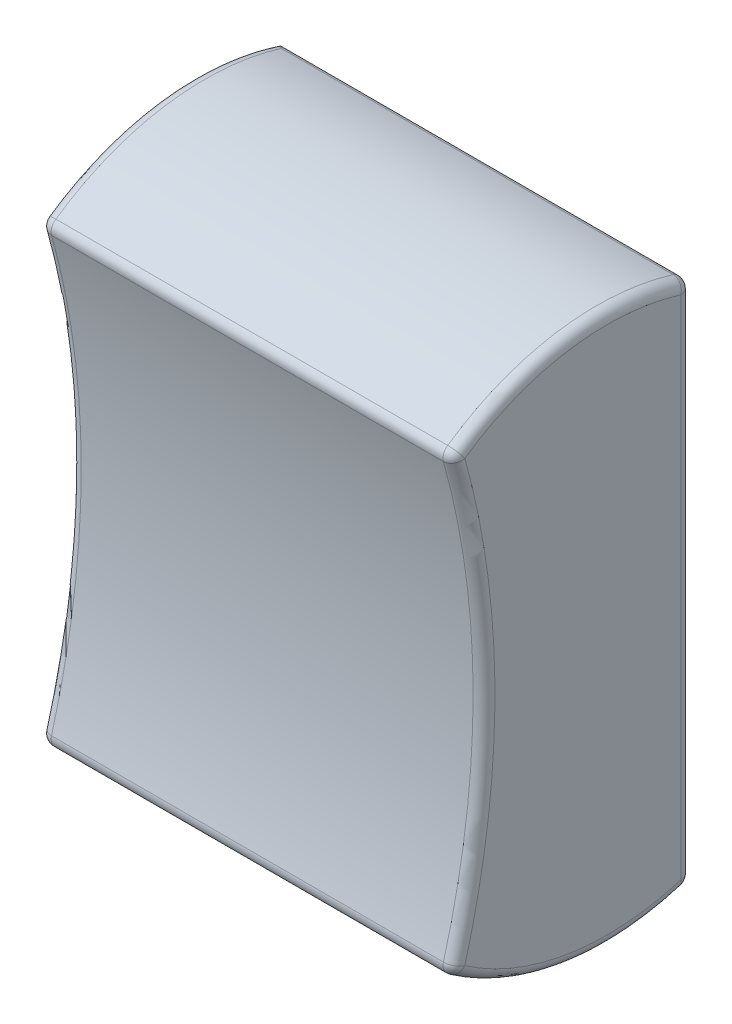
ISO-10303-21;
HEADER;
FILE_DESCRIPTION(('STEP AP214'),'2;1');
FILE_NAME('part.step','',(''),(''),'','','');
FILE_SCHEMA(('AUTOMOTIVE_DESIGN { 1 0 10303 214 1 1 1 1 }'));
ENDSEC;
DATA;
#1=APPLICATION_CONTEXT('core data for automotive mechanical design processes');
#2=APPLICATION_PROTOCOL_DEFINITION('international standard','automotive_design',2000,#1);
#3=PRODUCT_CONTEXT('',#1,'mechanical');
#4=PRODUCT('Part','Part','',(#3));
#5=PRODUCT_RELATED_PRODUCT_CATEGORY('part','',(#4));
#6=PRODUCT_DEFINITION_FORMATION('','',#4);
#7=PRODUCT_DEFINITION_CONTEXT('part definition',#1,'design');
#8=PRODUCT_DEFINITION('design','',#6,#7);
#9=PRODUCT_DEFINITION_SHAPE('','',#8);
#10=(LENGTH_UNIT() NAMED_UNIT(*) SI_UNIT(.MILLI.,.METRE.));
#11=(NAMED_UNIT(*) PLANE_ANGLE_UNIT() SI_UNIT($,.RADIAN.));
#12=(NAMED_UNIT(*) SI_UNIT($,.STERADIAN.) SOLID_ANGLE_UNIT());
#13=UNCERTAINTY_MEASURE_WITH_UNIT(LENGTH_MEASURE(1.E-05),#10,'distance_accuracy_value','');
#14=(GEOMETRIC_REPRESENTATION_CONTEXT(3) GLOBAL_UNCERTAINTY_ASSIGNED_CONTEXT((#13)) GLOBAL_UNIT_ASSIGNED_CONTEXT((#10,
#11,#12)) REPRESENTATION_CONTEXT('',''));
#15=CARTESIAN_POINT('',(0.,0.,0.));
#16=DIRECTION('',(0.,0.,1.));
#17=DIRECTION('',(1.,0.,0.));
#18=AXIS2_PLACEMENT_3D('',#15,#16,#17);
#19=CARTESIAN_POINT('',(9.5,-0.640134880450685,3.86697096777915));
#20=DIRECTION('',(-1.,0.,0.));
#21=DIRECTION('',(0.,0.,1.));
#22=AXIS2_PLACEMENT_3D('',#19,#20,#21);
#23=CYLINDRICAL_SURFACE('',#22,12.);
#24=DIRECTION('',(-1.,0.,0.));
#25=VECTOR('',#24,1.);
#26=CARTESIAN_POINT('',(9.5,-10.4992363122272,10.7078860350742));
#27=LINE('',#26,#25);
#28=CARTESIAN_POINT('',(9.,-10.4992363122272,10.7078860350742));
#29=VERTEX_POINT('',#28);
#30=CARTESIAN_POINT('',(-9.,-10.4992363122272,10.7078860350742));
#31=VERTEX_POINT('',#30);
#32=EDGE_CURVE('E305',#29,#31,#27,.T.);
#33=ORIENTED_EDGE('',*,*,#32,.T.);
#34=CARTESIAN_POINT('',(-9.,-0.640134880450685,3.86697096777915));
#35=DIRECTION('',(1.,0.,0.));
#36=DIRECTION('',(0.,0.,-1.));
#37=AXIS2_PLACEMENT_3D('',#34,#35,#36);
#38=CIRCLE('',#37,12.);
#39=CARTESIAN_POINT('',(-9.,-12.1142925582247,0.353609957922643));
#40=VERTEX_POINT('',#39);
#41=EDGE_CURVE('E300',#31,#40,#38,.T.);
#42=ORIENTED_EDGE('',*,*,#41,.T.);
#43=DIRECTION('',(-1.,0.,0.));
#44=VECTOR('',#43,1.);
#45=CARTESIAN_POINT('',(9.5,-12.1142925582247,0.353609957922643));
#46=LINE('',#45,#44);
#47=CARTESIAN_POINT('',(9.,-12.1142925582247,0.353609957922643));
#48=VERTEX_POINT('',#47);
#49=EDGE_CURVE('E302',#40,#48,#46,.F.);
#50=ORIENTED_EDGE('',*,*,#49,.T.);
#51=CARTESIAN_POINT('',(9.,-0.640134880450685,3.86697096777915));
#52=DIRECTION('',(1.,0.,0.));
#53=DIRECTION('',(0.,0.,-1.));
#54=AXIS2_PLACEMENT_3D('',#51,#52,#53);
#55=CIRCLE('',#54,12.);
#56=EDGE_CURVE('E133',#48,#29,#55,.F.);
#57=ORIENTED_EDGE('',*,*,#56,.T.);
#58=EDGE_LOOP('',(#33,#42,#50,#57));
#59=FACE_BOUND('',#58,.T.);
#60=ADVANCED_FACE('F33',(#59),#23,.T.);
#61=CARTESIAN_POINT('',(9.5,12.,0.));
#62=DIRECTION('',(0.,0.,1.));
#63=DIRECTION('',(0.,-1.,0.));
#64=AXIS2_PLACEMENT_3D('',#61,#62,#63);
#65=PLANE('',#64);
#66=DIRECTION('',(-1.,0.,0.));
#67=VECTOR('',#66,1.);
#68=CARTESIAN_POINT('',(9.5,-11.6362026549841,0.));
#69=LINE('',#68,#67);
#70=CARTESIAN_POINT('',(9.,-11.6362026549841,0.));
#71=VERTEX_POINT('',#70);
#72=CARTESIAN_POINT('',(-9.47497571321353,-11.6362026549841,0.));
#73=VERTEX_POINT('',#72);
#74=EDGE_CURVE('E129',#71,#73,#69,.T.);
#75=ORIENTED_EDGE('',*,*,#74,.T.);
#76=CARTESIAN_POINT('',(-9.47497571321353,-11.6362026549841,0.));
#77=CARTESIAN_POINT('',(-9.4833057981733,-11.6092114088466,0.));
#78=CARTESIAN_POINT('',(-9.48955619791181,-11.5819061148948,0.));
#79=CARTESIAN_POINT('',(-9.49789758816027,-11.5266676882119,0.));
#80=CARTESIAN_POINT('',(-9.49998861735058,-11.4987345613218,0.));
#81=CARTESIAN_POINT('',(-9.5,-11.4704873924585,0.));
#82=B_SPLINE_CURVE_WITH_KNOTS('',3,(#76,#77,#78,#79,#80,#81),.UNSPECIFIED.,.F.,.F.,(4,2,4),(0.,
0.0840346307910023,0.168068480092202),.UNSPECIFIED.);
#83=CARTESIAN_POINT('',(-9.5,-11.4704873924585,0.));
#84=VERTEX_POINT('',#83);
#85=EDGE_CURVE('E123',#73,#84,#82,.T.);
#86=ORIENTED_EDGE('',*,*,#85,.T.);
#87=DIRECTION('',(0.,1.,0.));
#88=VECTOR('',#87,1.);
#89=CARTESIAN_POINT('',(-9.5,12.,0.));
#90=LINE('',#89,#88);
#91=CARTESIAN_POINT('',(-9.5,11.4704873924585,0.));
#92=VERTEX_POINT('',#91);
#93=EDGE_CURVE('E126',#84,#92,#90,.T.);
#94=ORIENTED_EDGE('',*,*,#93,.T.);
#95=CARTESIAN_POINT('',(-9.5,11.4704873924585,0.));
#96=CARTESIAN_POINT('',(-9.49998861735058,11.4987345613218,0.));
#97=CARTESIAN_POINT('',(-9.49789758816027,11.5266676882119,0.));
#98=CARTESIAN_POINT('',(-9.48955619791181,11.5819061148948,0.));
#99=CARTESIAN_POINT('',(-9.4833057981733,11.6092114088466,0.));
#100=CARTESIAN_POINT('',(-9.47497571321353,11.6362026549841,0.));
#101=B_SPLINE_CURVE_WITH_KNOTS('',3,(#95,#96,#97,#98,#99,#100),.UNSPECIFIED.,.F.,.F.,(4,2,4),
(0.,0.084033849301201,0.168068480092204),.UNSPECIFIED.);
#102=CARTESIAN_POINT('',(-9.47497571321353,11.6362026549841,0.));
#103=VERTEX_POINT('',#102);
#104=EDGE_CURVE('E141',#92,#103,#101,.T.);
#105=ORIENTED_EDGE('',*,*,#104,.T.);
#106=DIRECTION('',(-1.,0.,0.));
#107=VECTOR('',#106,1.);
#108=CARTESIAN_POINT('',(9.5,11.6362026549841,0.));
#109=LINE('',#108,#107);
#110=CARTESIAN_POINT('',(9.,11.6362026549841,0.));
#111=VERTEX_POINT('',#110);
#112=EDGE_CURVE('E326',#103,#111,#109,.F.);
#113=ORIENTED_EDGE('',*,*,#112,.T.);
#114=DIRECTION('',(0.,1.,0.));
#115=VECTOR('',#114,1.);
#116=CARTESIAN_POINT('',(9.,-12.,0.));
#117=LINE('',#116,#115);
#118=EDGE_CURVE('E327',#111,#71,#117,.F.);
#119=ORIENTED_EDGE('',*,*,#118,.T.);
#120=EDGE_LOOP('',(#75,#86,#94,#105,#113,#119));
#121=FACE_BOUND('',#120,.T.);
#122=ADVANCED_FACE('F125',(#121),#65,.F.);
#123=CARTESIAN_POINT('',(9.5,0.640134880450685,3.86697096777915));
#124=DIRECTION('',(-1.,0.,0.));
#125=DIRECTION('',(0.,0.,1.));
#126=AXIS2_PLACEMENT_3D('',#123,#124,#125);
#127=CYLINDRICAL_SURFACE('',#126,12.);
#128=DIRECTION('',(-1.,0.,0.));
#129=VECTOR('',#128,1.);
#130=CARTESIAN_POINT('',(9.5,10.4992363122272,10.7078860350742));
#131=LINE('',#130,#129);
#132=CARTESIAN_POINT('',(-9.,10.4992363122272,10.7078860350742));
#133=VERTEX_POINT('',#132);
#134=CARTESIAN_POINT('',(9.,10.4992363122272,10.7078860350742));
#135=VERTEX_POINT('',#134);
#136=EDGE_CURVE('E53',#133,#135,#131,.F.);
#137=ORIENTED_EDGE('',*,*,#136,.T.);
#138=CARTESIAN_POINT('',(9.,0.640134880450685,3.86697096777915));
#139=DIRECTION('',(1.,0.,0.));
#140=DIRECTION('',(0.,0.,-1.));
#141=AXIS2_PLACEMENT_3D('',#138,#139,#140);
#142=CIRCLE('',#141,12.);
#143=CARTESIAN_POINT('',(9.,12.1142925582247,0.353609957922638));
#144=VERTEX_POINT('',#143);
#145=EDGE_CURVE('E11',#135,#144,#142,.F.);
#146=ORIENTED_EDGE('',*,*,#145,.T.);
#147=DIRECTION('',(-1.,0.,0.));
#148=VECTOR('',#147,1.);
#149=CARTESIAN_POINT('',(9.5,12.1142925582247,0.353609957922638));
#150=LINE('',#149,#148);
#151=CARTESIAN_POINT('',(-9.,12.1142925582247,0.353609957922638));
#152=VERTEX_POINT('',#151);
#153=EDGE_CURVE('E42',#144,#152,#150,.T.);
#154=ORIENTED_EDGE('',*,*,#153,.T.);
#155=CARTESIAN_POINT('',(-9.,0.640134880450685,3.86697096777915));
#156=DIRECTION('',(1.,0.,0.));
#157=DIRECTION('',(0.,0.,-1.));
#158=AXIS2_PLACEMENT_3D('',#155,#156,#157);
#159=CIRCLE('',#158,12.);
#160=EDGE_CURVE('E162',#152,#133,#159,.T.);
#161=ORIENTED_EDGE('',*,*,#160,.T.);
#162=EDGE_LOOP('',(#137,#146,#154,#161));
#163=FACE_BOUND('',#162,.T.);
#164=ADVANCED_FACE('F317',(#163),#127,.T.);
#165=CARTESIAN_POINT('',(9.5,0.,46.5403418666731));
#166=DIRECTION('',(-1.,0.,0.));
#167=DIRECTION('',(0.,0.,1.));
#168=AXIS2_PLACEMENT_3D('',#165,#166,#167);
#169=CYLINDRICAL_SURFACE('',#168,36.9999999999999);
#170=DIRECTION('',(-1.,0.,0.));
#171=VECTOR('',#170,1.);
#172=CARTESIAN_POINT('',(9.5,9.95392788031332,10.9044144933956));
#173=LINE('',#172,#171);
#174=CARTESIAN_POINT('',(9.,9.95392788031332,10.9044144933956));
#175=VERTEX_POINT('',#174);
#176=CARTESIAN_POINT('',(-9.,9.95392788031332,10.9044144933956));
#177=VERTEX_POINT('',#176);
#178=EDGE_CURVE('E253',#175,#177,#173,.T.);
#179=ORIENTED_EDGE('',*,*,#178,.T.);
#180=CARTESIAN_POINT('',(-9.,0.,46.5403418666731));
#181=DIRECTION('',(1.,0.,0.));
#182=DIRECTION('',(0.,0.,-1.));
#183=AXIS2_PLACEMENT_3D('',#180,#181,#182);
#184=CIRCLE('',#183,36.9999999999999);
#185=CARTESIAN_POINT('',(-9.,-9.95392788031332,10.9044144933956));
#186=VERTEX_POINT('',#185);
#187=EDGE_CURVE('E287',#177,#186,#184,.F.);
#188=ORIENTED_EDGE('',*,*,#187,.T.);
#189=DIRECTION('',(-1.,0.,0.));
#190=VECTOR('',#189,1.);
#191=CARTESIAN_POINT('',(9.5,-9.95392788031332,10.9044144933956));
#192=LINE('',#191,#190);
#193=CARTESIAN_POINT('',(9.,-9.95392788031332,10.9044144933956));
#194=VERTEX_POINT('',#193);
#195=EDGE_CURVE('E293',#186,#194,#192,.F.);
#196=ORIENTED_EDGE('',*,*,#195,.T.);
#197=CARTESIAN_POINT('',(9.,0.,46.5403418666731));
#198=DIRECTION('',(1.,0.,0.));
#199=DIRECTION('',(0.,0.,-1.));
#200=AXIS2_PLACEMENT_3D('',#197,#198,#199);
#201=CIRCLE('',#200,36.9999999999999);
#202=EDGE_CURVE('E298',#194,#175,#201,.T.);
#203=ORIENTED_EDGE('',*,*,#202,.T.);
#204=EDGE_LOOP('',(#179,#188,#196,#203));
#205=FACE_BOUND('',#204,.T.);
#206=ADVANCED_FACE('F354',(#205),#169,.F.);
#207=CARTESIAN_POINT('',(9.5,-0.640134880450685,3.86697096777915));
#208=DIRECTION('',(1.,0.,0.));
#209=DIRECTION('',(0.,0.,-1.));
#210=AXIS2_PLACEMENT_3D('',#207,#208,#209);
#211=PLANE('',#210);
#212=CARTESIAN_POINT('',(9.5,0.,46.5403418666731));
#213=DIRECTION('',(1.,0.,0.));
#214=DIRECTION('',(0.,0.,-1.));
#215=AXIS2_PLACEMENT_3D('',#212,#213,#214);
#216=CIRCLE('',#215,37.4999999999999);
#217=CARTESIAN_POINT('',(9.5,10.0884404192365,10.4228479072702));
#218=VERTEX_POINT('',#217);
#219=CARTESIAN_POINT('',(9.5,-10.0884404192365,10.4228479072702));
#220=VERTEX_POINT('',#219);
#221=EDGE_CURVE('E148',#218,#220,#216,.F.);
#222=ORIENTED_EDGE('',*,*,#221,.T.);
#223=CARTESIAN_POINT('',(9.5,-0.640134880450685,3.86697096777915));
#224=DIRECTION('',(1.,0.,0.));
#225=DIRECTION('',(0.,0.,-1.));
#226=AXIS2_PLACEMENT_3D('',#223,#224,#225);
#227=CIRCLE('',#226,11.5);
#228=CARTESIAN_POINT('',(9.5,-11.6362026549841,0.499999999999997));
#229=VERTEX_POINT('',#228);
#230=EDGE_CURVE('E159',#220,#229,#227,.T.);
#231=ORIENTED_EDGE('',*,*,#230,.T.);
#232=DIRECTION('',(0.,1.,0.));
#233=VECTOR('',#232,1.);
#234=CARTESIAN_POINT('',(9.5,12.,0.499999999999992));
#235=LINE('',#234,#233);
#236=CARTESIAN_POINT('',(9.5,11.6362026549841,0.499999999999993));
#237=VERTEX_POINT('',#236);
#238=EDGE_CURVE('E157',#229,#237,#235,.T.);
#239=ORIENTED_EDGE('',*,*,#238,.T.);
#240=CARTESIAN_POINT('',(9.5,0.640134880450685,3.86697096777915));
#241=DIRECTION('',(1.,0.,0.));
#242=DIRECTION('',(0.,0.,-1.));
#243=AXIS2_PLACEMENT_3D('',#240,#241,#242);
#244=CIRCLE('',#243,11.5);
#245=EDGE_CURVE('E150',#237,#218,#244,.T.);
#246=ORIENTED_EDGE('',*,*,#245,.T.);
#247=EDGE_LOOP('',(#222,#231,#239,#246));
#248=FACE_BOUND('',#247,.T.);
#249=ADVANCED_FACE('F356',(#248),#211,.T.);
#250=CARTESIAN_POINT('',(-9.5,-0.640134880450685,3.86697096777915));
#251=DIRECTION('',(1.,0.,0.));
#252=DIRECTION('',(0.,0.,-1.));
#253=AXIS2_PLACEMENT_3D('',#250,#251,#252);
#254=PLANE('',#253);
#255=ORIENTED_EDGE('',*,*,#93,.F.);
#256=CARTESIAN_POINT('',(-9.5,-0.640134880450685,3.86697096777915));
#257=DIRECTION('',(1.,0.,0.));
#258=DIRECTION('',(0.,0.,-1.));
#259=AXIS2_PLACEMENT_3D('',#256,#257,#258);
#260=CIRCLE('',#259,11.5);
#261=CARTESIAN_POINT('',(-9.5,-10.0884404192365,10.4228479072702));
#262=VERTEX_POINT('',#261);
#263=EDGE_CURVE('E137',#84,#262,#260,.F.);
#264=ORIENTED_EDGE('',*,*,#263,.T.);
#265=CARTESIAN_POINT('',(-9.5,0.,46.5403418666731));
#266=DIRECTION('',(1.,0.,0.));
#267=DIRECTION('',(0.,0.,-1.));
#268=AXIS2_PLACEMENT_3D('',#265,#266,#267);
#269=CIRCLE('',#268,37.4999999999999);
#270=CARTESIAN_POINT('',(-9.5,10.0884404192365,10.4228479072702));
#271=VERTEX_POINT('',#270);
#272=EDGE_CURVE('E152',#262,#271,#269,.T.);
#273=ORIENTED_EDGE('',*,*,#272,.T.);
#274=CARTESIAN_POINT('',(-9.5,0.640134880450685,3.86697096777915));
#275=DIRECTION('',(1.,0.,0.));
#276=DIRECTION('',(0.,0.,-1.));
#277=AXIS2_PLACEMENT_3D('',#274,#275,#276);
#278=CIRCLE('',#277,11.5);
#279=EDGE_CURVE('E140',#271,#92,#278,.F.);
#280=ORIENTED_EDGE('',*,*,#279,.T.);
#281=EDGE_LOOP('',(#255,#264,#273,#280));
#282=FACE_BOUND('',#281,.T.);
#283=ADVANCED_FACE('F136',(#282),#254,.F.);
#284=CARTESIAN_POINT('',(9.,10.0884404192365,10.4228479072702));
#285=DIRECTION('',(0.,0.,1.));
#286=DIRECTION('',(1.,0.,0.));
#287=AXIS2_PLACEMENT_3D('',#284,#285,#286);
#288=SPHERICAL_SURFACE('',#287,0.5);
#289=CARTESIAN_POINT('',(9.,10.0884404192365,10.4228479072702));
#290=DIRECTION('',(0.,-0.570076255607922,0.821591785981366));
#291=DIRECTION('',(0.,-0.821591785981366,-0.570076255607922));
#292=AXIS2_PLACEMENT_3D('',#289,#290,#291);
#293=CIRCLE('',#292,0.5);
#294=EDGE_CURVE('E236',#135,#218,#293,.F.);
#295=ORIENTED_EDGE('',*,*,#294,.F.);
#296=CARTESIAN_POINT('',(9.,10.0884404192365,10.4228479072702));
#297=DIRECTION('',(1.,0.,0.));
#298=DIRECTION('',(0.,0.,-1.));
#299=AXIS2_PLACEMENT_3D('',#296,#297,#298);
#300=CIRCLE('',#299,0.5);
#301=EDGE_CURVE('E37',#175,#135,#300,.F.);
#302=ORIENTED_EDGE('',*,*,#301,.F.);
#303=CARTESIAN_POINT('',(9.,10.0884404192365,10.4228479072702));
#304=DIRECTION('',(0.,0.963133172250747,0.269025077846309));
#305=DIRECTION('',(0.,-0.269025077846309,0.963133172250747));
#306=AXIS2_PLACEMENT_3D('',#303,#304,#305);
#307=CIRCLE('',#306,0.5);
#308=EDGE_CURVE('E240',#218,#175,#307,.F.);
#309=ORIENTED_EDGE('',*,*,#308,.F.);
#310=EDGE_LOOP('',(#295,#302,#309));
#311=FACE_BOUND('',#310,.T.);
#312=ADVANCED_FACE('F35',(#311),#288,.T.);
#313=CARTESIAN_POINT('',(-9.,0.640134880450685,3.86697096777915));
#314=DIRECTION('',(1.,0.,0.));
#315=DIRECTION('',(0.,0.,-1.));
#316=AXIS2_PLACEMENT_3D('',#313,#314,#315);
#317=TOROIDAL_SURFACE('',#316,11.5,0.5);
#318=CARTESIAN_POINT('',(-9.,10.0884404192365,10.4228479072702));
#319=DIRECTION('',(0.,-0.570076255607916,0.82159178598137));
#320=DIRECTION('',(0.,-0.821591785981371,-0.570076255607916));
#321=AXIS2_PLACEMENT_3D('',#318,#319,#320);
#322=CIRCLE('',#321,0.5);
#323=EDGE_CURVE('E237',#133,#271,#322,.T.);
#324=ORIENTED_EDGE('',*,*,#323,.F.);
#325=ORIENTED_EDGE('',*,*,#160,.F.);
#326=CARTESIAN_POINT('',(-9.47497571321353,11.6362026549841,0.));
#327=CARTESIAN_POINT('',(-9.46640399746119,11.6638253431885,-9.01411803888831E-07));
#328=CARTESIAN_POINT('',(-9.45595117015493,11.6906756128574,0.0022838511441019));
#329=CARTESIAN_POINT('',(-9.43222184747509,11.7421295878081,0.0106639742724501));
#330=CARTESIAN_POINT('',(-9.41897751307457,11.7667546673001,0.0167173591901579));
#331=CARTESIAN_POINT('',(-9.38681108403796,11.8195364690071,0.033801365125701));
#332=CARTESIAN_POINT('',(-9.36729698769206,11.8470401387613,0.0456972675888329));
#333=CARTESIAN_POINT('',(-9.3259701345595,11.8983675575789,0.0732415702032547));
#334=CARTESIAN_POINT('',(-9.30414531613349,11.9221702173033,0.0889102654175269));
#335=CARTESIAN_POINT('',(-9.25137166497688,11.9733924407981,0.128936412956604));
#336=CARTESIAN_POINT('',(-9.21983531756776,11.9993084615302,0.154439577995976));
#337=CARTESIAN_POINT('',(-9.15539930676128,12.0444321561339,0.209131444127782));
#338=CARTESIAN_POINT('',(-9.12250161737336,12.0636491871492,0.238314926281056));
#339=CARTESIAN_POINT('',(-9.06074074419095,12.0932753962198,0.295155870215498));
#340=CARTESIAN_POINT('',(-9.03195778952144,12.1045411953344,0.322454638209022));
#341=CARTESIAN_POINT('',(-9.00213046214546,12.1136519862499,0.351530080206579));
#342=CARTESIAN_POINT('',(-9.0010652104149,12.1139739747654,0.35256951981862));
#343=CARTESIAN_POINT('',(-9.,12.1142925582247,0.353609957922639));
#344=B_SPLINE_CURVE_WITH_KNOTS('',3,(#326,#327,#328,#329,#330,#331,#332,#333,#334,#335,#336,
#337,#338,#339,#340,#341,#342,#343),.UNSPECIFIED.,.F.,.F.,(4,2,2,2,2,2,2,2,4),(0.,
0.0863432253840962,0.171741318086226,0.278458713028091,0.385763530322396,0.529395344608982,
0.672825722541247,0.796168502398627,0.800736836754504),.UNSPECIFIED.);
#345=EDGE_CURVE('E229',#103,#152,#344,.T.);
#346=ORIENTED_EDGE('',*,*,#345,.F.);
#347=ORIENTED_EDGE('',*,*,#104,.F.);
#348=ORIENTED_EDGE('',*,*,#279,.F.);
#349=EDGE_LOOP('',(#324,#325,#346,#347,#348));
#350=FACE_BOUND('',#349,.T.);
#351=ADVANCED_FACE('F225',(#350),#317,.T.);
#352=CARTESIAN_POINT('',(9.5,10.0884404192365,10.4228479072702));
#353=DIRECTION('',(1.,0.,0.));
#354=DIRECTION('',(0.,0.,-1.));
#355=AXIS2_PLACEMENT_3D('',#352,#353,#354);
#356=CYLINDRICAL_SURFACE('',#355,0.5);
#357=ORIENTED_EDGE('',*,*,#301,.T.);
#358=ORIENTED_EDGE('',*,*,#136,.F.);
#359=CARTESIAN_POINT('',(-9.,10.0884404192365,10.4228479072702));
#360=DIRECTION('',(-1.,0.,0.));
#361=DIRECTION('',(0.,0.,1.));
#362=AXIS2_PLACEMENT_3D('',#359,#360,#361);
#363=CIRCLE('',#362,0.5);
#364=EDGE_CURVE('E278',#177,#133,#363,.T.);
#365=ORIENTED_EDGE('',*,*,#364,.F.);
#366=ORIENTED_EDGE('',*,*,#178,.F.);
#367=EDGE_LOOP('',(#357,#358,#365,#366));
#368=FACE_BOUND('',#367,.T.);
#369=ADVANCED_FACE('F250',(#368),#356,.T.);
#370=CARTESIAN_POINT('',(9.,0.,46.5403418666731));
#371=DIRECTION('',(1.,0.,0.));
#372=DIRECTION('',(0.,0.,-1.));
#373=AXIS2_PLACEMENT_3D('',#370,#371,#372);
#374=TOROIDAL_SURFACE('',#373,37.4999999999999,0.5);
#375=ORIENTED_EDGE('',*,*,#308,.T.);
#376=ORIENTED_EDGE('',*,*,#202,.F.);
#377=CARTESIAN_POINT('',(9.,-10.0884404192365,10.4228479072702));
#378=DIRECTION('',(0.,-0.963133172250747,0.269025077846309));
#379=DIRECTION('',(0.,-0.269025077846309,-0.963133172250747));
#380=AXIS2_PLACEMENT_3D('',#377,#378,#379);
#381=CIRCLE('',#380,0.5);
#382=EDGE_CURVE('E263',#220,#194,#381,.T.);
#383=ORIENTED_EDGE('',*,*,#382,.F.);
#384=ORIENTED_EDGE('',*,*,#221,.F.);
#385=EDGE_LOOP('',(#375,#376,#383,#384));
#386=FACE_BOUND('',#385,.T.);
#387=ADVANCED_FACE('F353',(#386),#374,.T.);
#388=CARTESIAN_POINT('',(9.,0.640134880450685,3.86697096777915));
#389=DIRECTION('',(1.,0.,0.));
#390=DIRECTION('',(0.,0.,-1.));
#391=AXIS2_PLACEMENT_3D('',#388,#389,#390);
#392=TOROIDAL_SURFACE('',#391,11.5,0.5);
#393=ORIENTED_EDGE('',*,*,#294,.T.);
#394=ORIENTED_EDGE('',*,*,#245,.F.);
#395=CARTESIAN_POINT('',(9.,11.6362026549841,0.499999999999993));
#396=DIRECTION('',(0.,-0.292780084154708,-0.956179806481167));
#397=DIRECTION('',(0.,0.956179806481167,-0.292780084154708));
#398=AXIS2_PLACEMENT_3D('',#395,#396,#397);
#399=CIRCLE('',#398,0.5);
#400=EDGE_CURVE('E259',#144,#237,#399,.T.);
#401=ORIENTED_EDGE('',*,*,#400,.F.);
#402=ORIENTED_EDGE('',*,*,#145,.F.);
#403=EDGE_LOOP('',(#393,#394,#401,#402));
#404=FACE_BOUND('',#403,.T.);
#405=ADVANCED_FACE('F223',(#404),#392,.T.);
#406=CARTESIAN_POINT('',(9.5,11.6362026549841,0.499999999999993));
#407=DIRECTION('',(-1.,0.,0.));
#408=DIRECTION('',(0.,0.,1.));
#409=AXIS2_PLACEMENT_3D('',#406,#407,#408);
#410=CYLINDRICAL_SURFACE('',#409,0.5);
#411=ORIENTED_EDGE('',*,*,#345,.T.);
#412=ORIENTED_EDGE('',*,*,#153,.F.);
#413=CARTESIAN_POINT('',(9.,11.6362026549841,0.499999999999993));
#414=DIRECTION('',(1.,0.,0.));
#415=DIRECTION('',(0.,0.,-1.));
#416=AXIS2_PLACEMENT_3D('',#413,#414,#415);
#417=CIRCLE('',#416,0.5);
#418=EDGE_CURVE('E264',#111,#144,#417,.T.);
#419=ORIENTED_EDGE('',*,*,#418,.F.);
#420=ORIENTED_EDGE('',*,*,#112,.F.);
#421=EDGE_LOOP('',(#411,#412,#419,#420));
#422=FACE_BOUND('',#421,.T.);
#423=ADVANCED_FACE('F218',(#422),#410,.T.);
#424=CARTESIAN_POINT('',(-9.,10.0884404192365,10.4228479072702));
#425=DIRECTION('',(0.,0.,1.));
#426=DIRECTION('',(1.,0.,0.));
#427=AXIS2_PLACEMENT_3D('',#424,#425,#426);
#428=SPHERICAL_SURFACE('',#427,0.5);
#429=ORIENTED_EDGE('',*,*,#364,.T.);
#430=ORIENTED_EDGE('',*,*,#323,.T.);
#431=CARTESIAN_POINT('',(-9.,10.0884404192365,10.4228479072702));
#432=DIRECTION('',(0.,0.96313317225075,0.269025077846299));
#433=DIRECTION('',(0.,-0.269025077846299,0.96313317225075));
#434=AXIS2_PLACEMENT_3D('',#431,#432,#433);
#435=CIRCLE('',#434,0.5);
#436=EDGE_CURVE('E270',#177,#271,#435,.F.);
#437=ORIENTED_EDGE('',*,*,#436,.F.);
#438=EDGE_LOOP('',(#429,#430,#437));
#439=FACE_BOUND('',#438,.T.);
#440=ADVANCED_FACE('F214',(#439),#428,.T.);
#441=CARTESIAN_POINT('',(9.,-10.0884404192365,10.4228479072702));
#442=DIRECTION('',(0.,0.,1.));
#443=DIRECTION('',(1.,0.,0.));
#444=AXIS2_PLACEMENT_3D('',#441,#442,#443);
#445=SPHERICAL_SURFACE('',#444,0.5);
#446=CARTESIAN_POINT('',(9.,-10.0884404192365,10.4228479072702));
#447=DIRECTION('',(0.,0.570076255607916,0.82159178598137));
#448=DIRECTION('',(0.,-0.821591785981371,0.570076255607916));
#449=AXIS2_PLACEMENT_3D('',#446,#447,#448);
#450=CIRCLE('',#449,0.5);
#451=EDGE_CURVE('E348',#220,#29,#450,.F.);
#452=ORIENTED_EDGE('',*,*,#451,.F.);
#453=ORIENTED_EDGE('',*,*,#382,.T.);
#454=CARTESIAN_POINT('',(9.,-10.0884404192365,10.4228479072702));
#455=DIRECTION('',(1.,0.,0.));
#456=DIRECTION('',(0.,0.,-1.));
#457=AXIS2_PLACEMENT_3D('',#454,#455,#456);
#458=CIRCLE('',#457,0.5);
#459=EDGE_CURVE('E273',#29,#194,#458,.F.);
#460=ORIENTED_EDGE('',*,*,#459,.F.);
#461=EDGE_LOOP('',(#452,#453,#460));
#462=FACE_BOUND('',#461,.T.);
#463=ADVANCED_FACE('F210',(#462),#445,.T.);
#464=CARTESIAN_POINT('',(9.,11.6362026549841,0.499999999999993));
#465=DIRECTION('',(0.,0.,1.));
#466=DIRECTION('',(1.,0.,0.));
#467=AXIS2_PLACEMENT_3D('',#464,#465,#466);
#468=SPHERICAL_SURFACE('',#467,0.5);
#469=ORIENTED_EDGE('',*,*,#418,.T.);
#470=ORIENTED_EDGE('',*,*,#400,.T.);
#471=CARTESIAN_POINT('',(9.,11.6362026549841,0.499999999999993));
#472=DIRECTION('',(0.,1.,0.));
#473=DIRECTION('',(0.,0.,1.));
#474=AXIS2_PLACEMENT_3D('',#471,#472,#473);
#475=CIRCLE('',#474,0.5);
#476=EDGE_CURVE('E267',#111,#237,#475,.F.);
#477=ORIENTED_EDGE('',*,*,#476,.F.);
#478=EDGE_LOOP('',(#469,#470,#477));
#479=FACE_BOUND('',#478,.T.);
#480=ADVANCED_FACE('F206',(#479),#468,.T.);
#481=CARTESIAN_POINT('',(-9.,0.,46.5403418666731));
#482=DIRECTION('',(1.,0.,0.));
#483=DIRECTION('',(0.,0.,-1.));
#484=AXIS2_PLACEMENT_3D('',#481,#482,#483);
#485=TOROIDAL_SURFACE('',#484,37.4999999999999,0.5);
#486=ORIENTED_EDGE('',*,*,#436,.T.);
#487=ORIENTED_EDGE('',*,*,#272,.F.);
#488=CARTESIAN_POINT('',(-9.,-10.0884404192365,10.4228479072702));
#489=DIRECTION('',(0.,-0.963133172250747,0.269025077846309));
#490=DIRECTION('',(0.,-0.269025077846309,-0.963133172250747));
#491=AXIS2_PLACEMENT_3D('',#488,#489,#490);
#492=CIRCLE('',#491,0.5);
#493=EDGE_CURVE('E288',#186,#262,#492,.T.);
#494=ORIENTED_EDGE('',*,*,#493,.F.);
#495=ORIENTED_EDGE('',*,*,#187,.F.);
#496=EDGE_LOOP('',(#486,#487,#494,#495));
#497=FACE_BOUND('',#496,.T.);
#498=ADVANCED_FACE('F202',(#497),#485,.T.);
#499=CARTESIAN_POINT('',(9.5,-10.0884404192365,10.4228479072702));
#500=DIRECTION('',(1.,0.,0.));
#501=DIRECTION('',(0.,0.,-1.));
#502=AXIS2_PLACEMENT_3D('',#499,#500,#501);
#503=CYLINDRICAL_SURFACE('',#502,0.5);
#504=ORIENTED_EDGE('',*,*,#459,.T.);
#505=ORIENTED_EDGE('',*,*,#195,.F.);
#506=CARTESIAN_POINT('',(-9.,-10.0884404192365,10.4228479072702));
#507=DIRECTION('',(-1.,0.,0.));
#508=DIRECTION('',(0.,0.,1.));
#509=AXIS2_PLACEMENT_3D('',#506,#507,#508);
#510=CIRCLE('',#509,0.5);
#511=EDGE_CURVE('E342',#31,#186,#510,.T.);
#512=ORIENTED_EDGE('',*,*,#511,.F.);
#513=ORIENTED_EDGE('',*,*,#32,.F.);
#514=EDGE_LOOP('',(#504,#505,#512,#513));
#515=FACE_BOUND('',#514,.T.);
#516=ADVANCED_FACE('F198',(#515),#503,.T.);
#517=CARTESIAN_POINT('',(9.,-0.640134880450685,3.86697096777915));
#518=DIRECTION('',(1.,0.,0.));
#519=DIRECTION('',(0.,0.,-1.));
#520=AXIS2_PLACEMENT_3D('',#517,#518,#519);
#521=TOROIDAL_SURFACE('',#520,11.5,0.5);
#522=ORIENTED_EDGE('',*,*,#451,.T.);
#523=ORIENTED_EDGE('',*,*,#56,.F.);
#524=CARTESIAN_POINT('',(9.,-11.6362026549841,0.499999999999997));
#525=DIRECTION('',(0.,0.292780084154707,-0.956179806481167));
#526=DIRECTION('',(0.,0.956179806481167,0.292780084154707));
#527=AXIS2_PLACEMENT_3D('',#524,#525,#526);
#528=CIRCLE('',#527,0.5);
#529=EDGE_CURVE('E334',#229,#48,#528,.T.);
#530=ORIENTED_EDGE('',*,*,#529,.F.);
#531=ORIENTED_EDGE('',*,*,#230,.F.);
#532=EDGE_LOOP('',(#522,#523,#530,#531));
#533=FACE_BOUND('',#532,.T.);
#534=ADVANCED_FACE('F194',(#533),#521,.T.);
#535=CARTESIAN_POINT('',(9.,-0.640134880450686,0.499999999999995));
#536=DIRECTION('',(0.,-1.,0.));
#537=DIRECTION('',(0.,0.,-1.));
#538=AXIS2_PLACEMENT_3D('',#535,#536,#537);
#539=CYLINDRICAL_SURFACE('',#538,0.5);
#540=ORIENTED_EDGE('',*,*,#476,.T.);
#541=ORIENTED_EDGE('',*,*,#238,.F.);
#542=CARTESIAN_POINT('',(9.,-11.6362026549841,0.499999999999997));
#543=DIRECTION('',(0.,-1.,0.));
#544=DIRECTION('',(0.,0.,-1.));
#545=AXIS2_PLACEMENT_3D('',#542,#543,#544);
#546=CIRCLE('',#545,0.5);
#547=EDGE_CURVE('E330',#71,#229,#546,.T.);
#548=ORIENTED_EDGE('',*,*,#547,.F.);
#549=ORIENTED_EDGE('',*,*,#118,.F.);
#550=EDGE_LOOP('',(#540,#541,#548,#549));
#551=FACE_BOUND('',#550,.T.);
#552=ADVANCED_FACE('F190',(#551),#539,.T.);
#553=CARTESIAN_POINT('',(-9.,-10.0884404192365,10.4228479072702));
#554=DIRECTION('',(0.,0.,1.));
#555=DIRECTION('',(1.,0.,0.));
#556=AXIS2_PLACEMENT_3D('',#553,#554,#555);
#557=SPHERICAL_SURFACE('',#556,0.5);
#558=ORIENTED_EDGE('',*,*,#511,.T.);
#559=ORIENTED_EDGE('',*,*,#493,.T.);
#560=CARTESIAN_POINT('',(-9.,-10.0884404192365,10.4228479072702));
#561=DIRECTION('',(0.,0.570076255607933,0.821591785981359));
#562=DIRECTION('',(0.,-0.821591785981359,0.570076255607933));
#563=AXIS2_PLACEMENT_3D('',#560,#561,#562);
#564=CIRCLE('',#563,0.5);
#565=EDGE_CURVE('E147',#31,#262,#564,.F.);
#566=ORIENTED_EDGE('',*,*,#565,.F.);
#567=EDGE_LOOP('',(#558,#559,#566));
#568=FACE_BOUND('',#567,.T.);
#569=ADVANCED_FACE('F186',(#568),#557,.T.);
#570=CARTESIAN_POINT('',(9.,-11.6362026549841,0.499999999999997));
#571=DIRECTION('',(0.,0.,1.));
#572=DIRECTION('',(1.,0.,0.));
#573=AXIS2_PLACEMENT_3D('',#570,#571,#572);
#574=SPHERICAL_SURFACE('',#573,0.5);
#575=ORIENTED_EDGE('',*,*,#547,.T.);
#576=ORIENTED_EDGE('',*,*,#529,.T.);
#577=CARTESIAN_POINT('',(9.,-11.6362026549841,0.499999999999997));
#578=DIRECTION('',(1.,0.,0.));
#579=DIRECTION('',(0.,0.,-1.));
#580=AXIS2_PLACEMENT_3D('',#577,#578,#579);
#581=CIRCLE('',#580,0.5);
#582=EDGE_CURVE('E174',#71,#48,#581,.F.);
#583=ORIENTED_EDGE('',*,*,#582,.F.);
#584=EDGE_LOOP('',(#575,#576,#583));
#585=FACE_BOUND('',#584,.T.);
#586=ADVANCED_FACE('F183',(#585),#574,.T.);
#587=CARTESIAN_POINT('',(-9.,-0.640134880450685,3.86697096777915));
#588=DIRECTION('',(1.,0.,0.));
#589=DIRECTION('',(0.,0.,-1.));
#590=AXIS2_PLACEMENT_3D('',#587,#588,#589);
#591=TOROIDAL_SURFACE('',#590,11.5,0.5);
#592=ORIENTED_EDGE('',*,*,#263,.F.);
#593=ORIENTED_EDGE('',*,*,#85,.F.);
#594=CARTESIAN_POINT('',(-9.47497571321353,-11.6362026549841,0.));
#595=CARTESIAN_POINT('',(-9.46640399746119,-11.6638253431885,-9.0141179710129E-07));
#596=CARTESIAN_POINT('',(-9.45595117015493,-11.6906756128574,0.0022838511441076));
#597=CARTESIAN_POINT('',(-9.43222184747509,-11.7421295878081,0.0106639742724536));
#598=CARTESIAN_POINT('',(-9.41897751307457,-11.7667546673001,0.0167173591901599));
#599=CARTESIAN_POINT('',(-9.38681108403797,-11.8195364690071,0.0338013651257075));
#600=CARTESIAN_POINT('',(-9.36729698769207,-11.8470401387613,0.0456972675888475));
#601=CARTESIAN_POINT('',(-9.32597013455949,-11.8983675575789,0.0732415702032487));
#602=CARTESIAN_POINT('',(-9.30414531613345,-11.9221702173033,0.088910265417492));
#603=CARTESIAN_POINT('',(-9.25137166497695,-11.9733924407981,0.128936412956664));
#604=CARTESIAN_POINT('',(-9.21983531756801,-11.9993084615303,0.154439577996216));
#605=CARTESIAN_POINT('',(-9.15539930676103,-12.0444321561338,0.209131444127552));
#606=CARTESIAN_POINT('',(-9.12250161737242,-12.0636491871489,0.238314926280179));
#607=CARTESIAN_POINT('',(-9.06074074419176,-12.09327539622,0.295155870216262));
#608=CARTESIAN_POINT('',(-9.03195778952428,-12.1045411953352,0.322454638211678));
#609=CARTESIAN_POINT('',(-9.00213046214567,-12.1136519862499,0.351530080206777));
#610=CARTESIAN_POINT('',(-9.00106521041501,-12.1139739747655,0.352569519818724));
#611=CARTESIAN_POINT('',(-9.,-12.1142925582247,0.353609957922643));
#612=B_SPLINE_CURVE_WITH_KNOTS('',3,(#594,#595,#596,#597,#598,#599,#600,#601,#602,#603,#604,
#605,#606,#607,#608,#609,#610,#611),.UNSPECIFIED.,.F.,.F.,(4,2,2,2,2,2,2,2,4),(0.,
0.0863432253840995,0.171741318086226,0.27845871302809,0.385763530322396,0.529395344608984,
0.672825722541246,0.796168502398629,0.800736836754505),.UNSPECIFIED.);
#613=EDGE_CURVE('E166',#40,#73,#612,.F.);
#614=ORIENTED_EDGE('',*,*,#613,.F.);
#615=ORIENTED_EDGE('',*,*,#41,.F.);
#616=ORIENTED_EDGE('',*,*,#565,.T.);
#617=EDGE_LOOP('',(#592,#593,#614,#615,#616));
#618=FACE_BOUND('',#617,.T.);
#619=ADVANCED_FACE('F144',(#618),#591,.T.);
#620=CARTESIAN_POINT('',(9.5,-11.6362026549841,0.499999999999997));
#621=DIRECTION('',(-1.,0.,0.));
#622=DIRECTION('',(0.,0.,1.));
#623=AXIS2_PLACEMENT_3D('',#620,#621,#622);
#624=CYLINDRICAL_SURFACE('',#623,0.5);
#625=ORIENTED_EDGE('',*,*,#582,.T.);
#626=ORIENTED_EDGE('',*,*,#49,.F.);
#627=ORIENTED_EDGE('',*,*,#613,.T.);
#628=ORIENTED_EDGE('',*,*,#74,.F.);
#629=EDGE_LOOP('',(#625,#626,#627,#628));
#630=FACE_BOUND('',#629,.T.);
#631=ADVANCED_FACE('F178',(#630),#624,.T.);
#632=CLOSED_SHELL('',(#60,#122,#164,#206,#249,#283,#312,#351,#369,#387,#405,#423,#440,#463,#480,
#498,#516,#534,#552,#569,#586,#619,#631));
#633=MANIFOLD_SOLID_BREP('B2',#632);
#634=ADVANCED_BREP_SHAPE_REPRESENTATION('',(#18,#633),#14);
#635=SHAPE_DEFINITION_REPRESENTATION(#9,#634);
ENDSEC;
END-ISO-10303-21;
